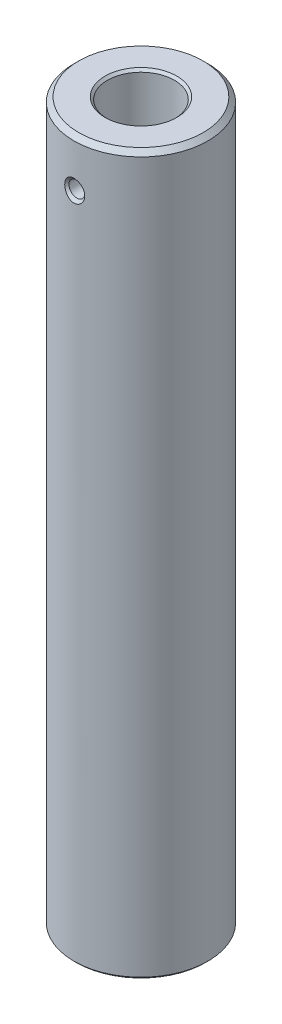
ISO-10303-21;
HEADER;
FILE_DESCRIPTION(('STEP AP214'),'2;1');
FILE_NAME('part.step','',(''),(''),'','','');
FILE_SCHEMA(('AUTOMOTIVE_DESIGN { 1 0 10303 214 1 1 1 1 }'));
ENDSEC;
DATA;
#1=APPLICATION_CONTEXT('core data for automotive mechanical design processes');
#2=APPLICATION_PROTOCOL_DEFINITION('international standard','automotive_design',2000,#1);
#3=PRODUCT_CONTEXT('',#1,'mechanical');
#4=PRODUCT('Part','Part','',(#3));
#5=PRODUCT_RELATED_PRODUCT_CATEGORY('part','',(#4));
#6=PRODUCT_DEFINITION_FORMATION('','',#4);
#7=PRODUCT_DEFINITION_CONTEXT('part definition',#1,'design');
#8=PRODUCT_DEFINITION('design','',#6,#7);
#9=PRODUCT_DEFINITION_SHAPE('','',#8);
#10=(LENGTH_UNIT() NAMED_UNIT(*) SI_UNIT(.MILLI.,.METRE.));
#11=(NAMED_UNIT(*) PLANE_ANGLE_UNIT() SI_UNIT($,.RADIAN.));
#12=(NAMED_UNIT(*) SI_UNIT($,.STERADIAN.) SOLID_ANGLE_UNIT());
#13=UNCERTAINTY_MEASURE_WITH_UNIT(LENGTH_MEASURE(1.E-05),#10,'distance_accuracy_value','');
#14=(GEOMETRIC_REPRESENTATION_CONTEXT(3) GLOBAL_UNCERTAINTY_ASSIGNED_CONTEXT((#13)) GLOBAL_UNIT_ASSIGNED_CONTEXT((#10,
#11,#12)) REPRESENTATION_CONTEXT('',''));
#15=CARTESIAN_POINT('',(0.,0.,0.));
#16=DIRECTION('',(0.,0.,1.));
#17=DIRECTION('',(1.,0.,0.));
#18=AXIS2_PLACEMENT_3D('',#15,#16,#17);
#19=CARTESIAN_POINT('',(0.,150.,0.));
#20=DIRECTION('',(0.,-1.,0.));
#21=DIRECTION('',(0.,0.,-1.));
#22=AXIS2_PLACEMENT_3D('',#19,#20,#21);
#23=CYLINDRICAL_SURFACE('',#22,14.);
#24=CARTESIAN_POINT('',(-1.53135776022729,138.468176963126,13.9159959942111));
#25=CARTESIAN_POINT('',(-1.60127764476214,138.548957642016,13.9083021061078));
#26=CARTESIAN_POINT('',(-1.66533345422651,138.634852905506,13.9007208756863));
#27=CARTESIAN_POINT('',(-1.78077358937562,138.814893823729,13.8864046729967));
#28=CARTESIAN_POINT('',(-1.83214645337011,138.909046837703,13.8796704688696));
#29=CARTESIAN_POINT('',(-1.92996888788323,139.12211198582,13.8664386029846));
#30=CARTESIAN_POINT('',(-1.97363320464747,139.242331559543,13.860228447879));
#31=CARTESIAN_POINT('',(-2.04115702723578,139.488323793423,13.8504456580711));
#32=CARTESIAN_POINT('',(-2.06500845486323,139.614098696633,13.8468740992544));
#33=CARTESIAN_POINT('',(-2.09298715096072,139.872668446938,13.8426739939634));
#34=CARTESIAN_POINT('',(-2.09634077625566,140.005549620874,13.8421608995439));
#35=CARTESIAN_POINT('',(-2.08118716452946,140.270034328525,13.8444470601918));
#36=CARTESIAN_POINT('',(-2.06267853304951,140.401637780201,13.8472465265471));
#37=CARTESIAN_POINT('',(-2.00385336318689,140.661192268973,13.8558817867143));
#38=CARTESIAN_POINT('',(-1.96331849847957,140.789093005199,13.8617479555388));
#39=CARTESIAN_POINT('',(-1.8610882733508,141.036032734745,13.8758422940061));
#40=CARTESIAN_POINT('',(-1.7993923636138,141.15507149792,13.8840705249645));
#41=CARTESIAN_POINT('',(-1.65748223155586,141.378306469293,13.9017175784515));
#42=CARTESIAN_POINT('',(-1.57764065490372,141.482740982984,13.9111109155746));
#43=CARTESIAN_POINT('',(-1.40059493770747,141.675703388028,13.9300476949973));
#44=CARTESIAN_POINT('',(-1.30339610890895,141.764236129135,13.9395910905627));
#45=CARTESIAN_POINT('',(-1.0999170018714,141.917452612588,13.9570775487696));
#46=CARTESIAN_POINT('',(-0.994428442648153,141.983178961701,13.9650797110893));
#47=CARTESIAN_POINT('',(-0.773133020119913,142.094348315229,13.9790739984405));
#48=CARTESIAN_POINT('',(-0.657332390298212,142.139803474743,13.9850673274803));
#49=CARTESIAN_POINT('',(-0.428327101943259,142.205583837824,13.9938787985151));
#50=CARTESIAN_POINT('',(-0.315607150891731,142.227572179828,13.9969056017207));
#51=CARTESIAN_POINT('',(-0.0880285048525282,142.251367596664,14.0001849305751));
#52=CARTESIAN_POINT('',(0.0268294141370952,142.253181856144,14.0004384438823));
#53=CARTESIAN_POINT('',(0.249211116987518,142.23698461402,13.9982013994123));
#54=CARTESIAN_POINT('',(0.356811134085362,142.219975279489,13.9958495447503));
#55=CARTESIAN_POINT('',(0.567640413666256,142.168445480423,13.9888853894585));
#56=CARTESIAN_POINT('',(0.670869639044375,142.133924867263,13.9842730696431));
#57=CARTESIAN_POINT('',(0.871296729335743,142.048301486374,13.9732254623816));
#58=CARTESIAN_POINT('',(0.968423934262403,141.997036303114,13.9667724014763));
#59=CARTESIAN_POINT('',(1.1532880828759,141.879856250496,13.9527250532927));
#60=CARTESIAN_POINT('',(1.24102283340762,141.81393797062,13.9451305004649));
#61=CARTESIAN_POINT('',(1.41028376270478,141.665167417869,13.9290618468448));
#62=CARTESIAN_POINT('',(1.49112308764273,141.581537223889,13.9205623107645));
#63=CARTESIAN_POINT('',(1.63874712127917,141.402652045635,13.903957675865));
#64=CARTESIAN_POINT('',(1.70552733334932,141.307393357478,13.8958527038773));
#65=CARTESIAN_POINT('',(1.82818769716662,141.100538358997,13.8802679531317));
#66=CARTESIAN_POINT('',(1.88292721894083,140.988258352901,13.8728760468477));
#67=CARTESIAN_POINT('',(1.97394595926302,140.756338490784,13.8602184306113));
#68=CARTESIAN_POINT('',(2.01022039243926,140.636696735905,13.854953271895));
#69=CARTESIAN_POINT('',(2.06505190998251,140.386869742714,13.8468906918943));
#70=CARTESIAN_POINT('',(2.08260411797717,140.256458525243,13.8442337938247));
#71=CARTESIAN_POINT('',(2.09627245927022,139.994484997263,13.8421706416678));
#72=CARTESIAN_POINT('',(2.09238539951781,139.862922518205,13.842764871786));
#73=CARTESIAN_POINT('',(2.06295333228332,139.599656131464,13.8471820432034));
#74=CARTESIAN_POINT('',(2.03698336478367,139.468000450473,13.8510683307278));
#75=CARTESIAN_POINT('',(1.96331839276869,139.211010689411,13.8617010339261));
#76=CARTESIAN_POINT('',(1.91562206802213,139.085676994017,13.8684476234084));
#77=CARTESIAN_POINT('',(1.79996028300474,138.846192891427,13.8839297212903));
#78=CARTESIAN_POINT('',(1.73217434096815,138.731954861105,13.8926474587093));
#79=CARTESIAN_POINT('',(1.57760105894845,138.517196760224,13.9110463033582));
#80=CARTESIAN_POINT('',(1.49081689892042,138.416674398477,13.9207272492169));
#81=CARTESIAN_POINT('',(1.30437387879809,138.237031205091,13.9394042422191));
#82=CARTESIAN_POINT('',(1.2054197936225,138.157181839928,13.9484119055677));
#83=CARTESIAN_POINT('',(0.994544195131819,138.016773832754,13.9650285578943));
#84=CARTESIAN_POINT('',(0.882629862947548,137.956204576934,13.972638315448));
#85=CARTESIAN_POINT('',(0.657880600130233,137.860850041201,13.9849528210744));
#86=CARTESIAN_POINT('',(0.545722145073133,137.824492756417,13.9898304105963));
#87=CARTESIAN_POINT('',(0.31663823744272,137.772444103654,13.9968866996364));
#88=CARTESIAN_POINT('',(0.199715209735977,137.756742355457,13.9990667547388));
#89=CARTESIAN_POINT('',(-0.0273628075260406,137.747082906316,14.0004037892334));
#90=CARTESIAN_POINT('',(-0.137461322916734,137.751772604662,13.9997488333666));
#91=CARTESIAN_POINT('',(-0.35524707084623,137.779643843199,13.995915803131));
#92=CARTESIAN_POINT('',(-0.462934261837606,137.802825701761,13.9927376853221));
#93=CARTESIAN_POINT('',(-0.671693957348671,137.866335623105,13.9842639363403));
#94=CARTESIAN_POINT('',(-0.772826536229986,137.906470843267,13.9789921594535));
#95=CARTESIAN_POINT('',(-0.967253953326416,138.002324603407,13.9668862467392));
#96=CARTESIAN_POINT('',(-1.06055160164878,138.058037524917,13.9600526743723));
#97=CARTESIAN_POINT('',(-1.21943577141882,138.170492445145,13.9469709891212));
#98=CARTESIAN_POINT('',(-1.28681335132365,138.224754034039,13.9408833789934));
#99=CARTESIAN_POINT('',(-1.41452195716676,138.34095723969,13.9285046220588));
#100=CARTESIAN_POINT('',(-1.47485461442085,138.402897071605,13.9222135228042));
#101=CARTESIAN_POINT('',(-1.53135776022729,138.468176963126,13.9159959942111));
#102=B_SPLINE_CURVE_WITH_KNOTS('',3,(#24,#25,#26,#27,#28,#29,#30,#31,#32,#33,#34,#35,#36,#37,
#38,#39,#40,#41,#42,#43,#44,#45,#46,#47,#48,#49,#50,#51,#52,#53,#54,#55,#56,#57,#58,#59,#60,#61,
#62,#63,#64,#65,#66,#67,#68,#69,#70,#71,#72,#73,#74,#75,#76,#77,#78,#79,#80,#81,#82,#83,#84,#85,
#86,#87,#88,#89,#90,#91,#92,#93,#94,#95,#96,#97,#98,#99,#100,#101),.UNSPECIFIED.,.T.,.F.,(4,2,2,
2,2,2,2,2,2,2,2,2,2,2,2,2,2,2,2,2,2,2,2,2,2,2,2,2,2,2,2,2,2,2,2,2,2,2,4),(0.,0.321111598311164,
0.642512334418354,1.02491696386992,1.40747743256409,1.80439185218487,2.201331589901,
2.60227957691264,3.00323797284468,3.39660650326646,3.78985485890881,4.16151011353402,
4.53294221399786,4.87582246978047,5.21858061081795,5.54393186724936,5.86928588512925,
6.19789438592272,6.52657945080125,6.87495603822549,7.22344388075731,7.5971862908592,
7.97102550997304,8.36405163147757,8.75713628978807,9.15796118760692,9.5588104453382,
9.95618054845076,10.3534841898444,10.7338858266659,11.1140776866143,11.4662331807764,
11.8182116352824,12.1472118287886,12.4762176866548,12.8015778480361,13.1268208115693,
13.3863753902016,13.6458697469245),.UNSPECIFIED.);
#103=CARTESIAN_POINT('',(-1.53135776022729,138.468176963126,13.9159959942111));
#104=VERTEX_POINT('',#103);
#105=EDGE_CURVE('E11',#104,#104,#102,.T.);
#106=ORIENTED_EDGE('',*,*,#105,.T.);
#107=EDGE_LOOP('',(#106));
#108=FACE_BOUND('',#107,.T.);
#109=CARTESIAN_POINT('',(0.,0.499999999999973,0.));
#110=DIRECTION('',(0.,1.,0.));
#111=DIRECTION('',(0.,0.,1.));
#112=AXIS2_PLACEMENT_3D('',#109,#110,#111);
#113=CIRCLE('',#112,14.);
#114=CARTESIAN_POINT('',(0.,0.499999999999973,14.));
#115=VERTEX_POINT('',#114);
#116=EDGE_CURVE('E86',#115,#115,#113,.T.);
#117=ORIENTED_EDGE('',*,*,#116,.T.);
#118=EDGE_LOOP('',(#117));
#119=FACE_BOUND('',#118,.T.);
#120=CARTESIAN_POINT('',(0.,149.,0.));
#121=DIRECTION('',(0.,1.,0.));
#122=DIRECTION('',(0.,0.,1.));
#123=AXIS2_PLACEMENT_3D('',#120,#121,#122);
#124=CIRCLE('',#123,14.);
#125=CARTESIAN_POINT('',(0.,149.,14.));
#126=VERTEX_POINT('',#125);
#127=EDGE_CURVE('E83',#126,#126,#124,.F.);
#128=ORIENTED_EDGE('',*,*,#127,.T.);
#129=EDGE_LOOP('',(#128));
#130=FACE_BOUND('',#129,.T.);
#131=ADVANCED_FACE('F36',(#108,#119,#130),#23,.T.);
#132=CARTESIAN_POINT('',(0.,150.,0.));
#133=DIRECTION('',(0.,1.,0.));
#134=DIRECTION('',(0.,0.,1.));
#135=AXIS2_PLACEMENT_3D('',#132,#133,#134);
#136=PLANE('',#135);
#137=CARTESIAN_POINT('',(0.,150.,0.));
#138=DIRECTION('',(0.,1.,0.));
#139=DIRECTION('',(0.,0.,1.));
#140=AXIS2_PLACEMENT_3D('',#137,#138,#139);
#141=CIRCLE('',#140,7.5);
#142=CARTESIAN_POINT('',(0.,150.,7.5));
#143=VERTEX_POINT('',#142);
#144=EDGE_CURVE('E65',#143,#143,#141,.T.);
#145=ORIENTED_EDGE('',*,*,#144,.F.);
#146=EDGE_LOOP('',(#145));
#147=FACE_BOUND('',#146,.T.);
#148=CARTESIAN_POINT('',(0.,150.,0.));
#149=DIRECTION('',(0.,1.,0.));
#150=DIRECTION('',(0.,0.,1.));
#151=AXIS2_PLACEMENT_3D('',#148,#149,#150);
#152=CIRCLE('',#151,13.);
#153=CARTESIAN_POINT('',(0.,150.,13.));
#154=VERTEX_POINT('',#153);
#155=EDGE_CURVE('E80',#154,#154,#152,.T.);
#156=ORIENTED_EDGE('',*,*,#155,.T.);
#157=EDGE_LOOP('',(#156));
#158=FACE_BOUND('',#157,.T.);
#159=ADVANCED_FACE('F97',(#147,#158),#136,.T.);
#160=CARTESIAN_POINT('',(0.,0.,0.));
#161=DIRECTION('',(0.,1.,0.));
#162=DIRECTION('',(0.,0.,1.));
#163=AXIS2_PLACEMENT_3D('',#160,#161,#162);
#164=PLANE('',#163);
#165=CARTESIAN_POINT('',(0.,0.,0.));
#166=DIRECTION('',(0.,-1.,0.));
#167=DIRECTION('',(0.,0.,-1.));
#168=AXIS2_PLACEMENT_3D('',#165,#166,#167);
#169=CIRCLE('',#168,3.5);
#170=CARTESIAN_POINT('',(0.,0.,-3.5));
#171=VERTEX_POINT('',#170);
#172=EDGE_CURVE('E66',#171,#171,#169,.T.);
#173=ORIENTED_EDGE('',*,*,#172,.F.);
#174=EDGE_LOOP('',(#173));
#175=FACE_BOUND('',#174,.T.);
#176=CARTESIAN_POINT('',(0.,0.,0.));
#177=DIRECTION('',(0.,1.,0.));
#178=DIRECTION('',(0.,0.,1.));
#179=AXIS2_PLACEMENT_3D('',#176,#177,#178);
#180=CIRCLE('',#179,13.5);
#181=CARTESIAN_POINT('',(0.,0.,13.5));
#182=VERTEX_POINT('',#181);
#183=EDGE_CURVE('E49',#182,#182,#180,.F.);
#184=ORIENTED_EDGE('',*,*,#183,.T.);
#185=EDGE_LOOP('',(#184));
#186=FACE_BOUND('',#185,.T.);
#187=ADVANCED_FACE('F99',(#175,#186),#164,.F.);
#188=CARTESIAN_POINT('',(0.,150.,0.));
#189=DIRECTION('',(0.,-1.,0.));
#190=DIRECTION('',(0.,0.,-1.));
#191=AXIS2_PLACEMENT_3D('',#188,#189,#190);
#192=CONICAL_SURFACE('',#191,13.,0.785398163397456);
#193=ORIENTED_EDGE('',*,*,#127,.F.);
#194=EDGE_LOOP('',(#193));
#195=FACE_BOUND('',#194,.T.);
#196=ORIENTED_EDGE('',*,*,#155,.F.);
#197=EDGE_LOOP('',(#196));
#198=FACE_BOUND('',#197,.T.);
#199=ADVANCED_FACE('F101',(#195,#198),#192,.T.);
#200=CARTESIAN_POINT('',(0.,115.,0.));
#201=DIRECTION('',(0.,1.,0.));
#202=DIRECTION('',(0.,0.,1.));
#203=AXIS2_PLACEMENT_3D('',#200,#201,#202);
#204=CONICAL_SURFACE('',#203,6.99999999999999,1.02974425867665);
#205=CARTESIAN_POINT('',(0.,110.793975666807,0.));
#206=VERTEX_POINT('',#205);
#207=VERTEX_LOOP('',#206);
#208=FACE_BOUND('',#207,.T.);
#209=CARTESIAN_POINT('',(0.,115.,0.));
#210=DIRECTION('',(0.,1.,0.));
#211=DIRECTION('',(0.,0.,1.));
#212=AXIS2_PLACEMENT_3D('',#209,#210,#211);
#213=CIRCLE('',#212,6.99999999999999);
#214=CARTESIAN_POINT('',(0.,115.,6.99999999999999));
#215=VERTEX_POINT('',#214);
#216=EDGE_CURVE('E77',#215,#215,#213,.T.);
#217=ORIENTED_EDGE('',*,*,#216,.T.);
#218=EDGE_LOOP('',(#217));
#219=FACE_BOUND('',#218,.T.);
#220=ADVANCED_FACE('F103',(#208,#219),#204,.F.);
#221=CARTESIAN_POINT('',(0.,150.,0.));
#222=DIRECTION('',(0.,1.,0.));
#223=DIRECTION('',(0.,0.,1.));
#224=AXIS2_PLACEMENT_3D('',#221,#222,#223);
#225=CYLINDRICAL_SURFACE('',#224,6.99999999999999);
#226=CARTESIAN_POINT('',(0.,138.35,6.99999999999999));
#227=CARTESIAN_POINT('',(0.0913287393176132,138.350002843879,6.99999836647251));
#228=CARTESIAN_POINT('',(0.182690417283305,138.357608230849,6.99819467849872));
#229=CARTESIAN_POINT('',(0.362806323664361,138.387789901469,6.99117390365259));
#230=CARTESIAN_POINT('',(0.451558855012931,138.410375713275,6.98595464436712));
#231=CARTESIAN_POINT('',(0.623828476855956,138.469761774017,6.97268218331076));
#232=CARTESIAN_POINT('',(0.70735134881968,138.506545992007,6.96463217854925));
#233=CARTESIAN_POINT('',(0.867039208328412,138.593230848715,6.94656095410579));
#234=CARTESIAN_POINT('',(0.943204151262114,138.643131566953,6.93653972247337));
#235=CARTESIAN_POINT('',(1.0874214344422,138.755606821652,6.91541181493804));
#236=CARTESIAN_POINT('',(1.15531854158778,138.818377553555,6.90428991213627));
#237=CARTESIAN_POINT('',(1.2797250827413,138.954390409173,6.88231817514456));
#238=CARTESIAN_POINT('',(1.33623336463363,139.027633591022,6.87146836857752));
#239=CARTESIAN_POINT('',(1.4369668461877,139.183690367456,6.85111743990826));
#240=CARTESIAN_POINT('',(1.48102236520304,139.266616250423,6.84163573776828));
#241=CARTESIAN_POINT('',(1.55450989151089,139.438955721702,6.8253150534534));
#242=CARTESIAN_POINT('',(1.58394395433771,139.528368396052,6.81847569983818));
#243=CARTESIAN_POINT('',(1.62683125284545,139.709446972031,6.80836995693016));
#244=CARTESIAN_POINT('',(1.64056162843083,139.801043704224,6.80504168835828));
#245=CARTESIAN_POINT('',(1.6525143545755,139.985296353664,6.80214944752778));
#246=CARTESIAN_POINT('',(1.6507389330696,140.077952116834,6.80258493447764));
#247=CARTESIAN_POINT('',(1.63195247769313,140.259599180796,6.80711518628286));
#248=CARTESIAN_POINT('',(1.61526770664354,140.348626479963,6.81113158544196));
#249=CARTESIAN_POINT('',(1.56765494743682,140.522581519513,6.82224669705885));
#250=CARTESIAN_POINT('',(1.53672604569691,140.607508996556,6.82934560721948));
#251=CARTESIAN_POINT('',(1.46121486998611,140.771748397053,6.84590028619907));
#252=CARTESIAN_POINT('',(1.41651088097452,140.851002169397,6.85537691977426));
#253=CARTESIAN_POINT('',(1.31480384080149,141.001002120948,6.87560701771075));
#254=CARTESIAN_POINT('',(1.25779885989576,141.071746962584,6.88636068228984));
#255=CARTESIAN_POINT('',(1.13140044923304,141.204594797696,6.90826612497408));
#256=CARTESIAN_POINT('',(1.06173067039406,141.266434627954,6.91942110106381));
#257=CARTESIAN_POINT('',(0.912878848692445,141.377599647001,6.94062641864199));
#258=CARTESIAN_POINT('',(0.833696575268972,141.426924532367,6.9506767333447));
#259=CARTESIAN_POINT('',(0.667717693598582,141.511741023479,6.96858169507369));
#260=CARTESIAN_POINT('',(0.580900533100744,141.547193798679,6.97643016161575));
#261=CARTESIAN_POINT('',(0.402313719817352,141.602931553437,6.98900179511063));
#262=CARTESIAN_POINT('',(0.310544909289154,141.623219103878,6.99372549177408));
#263=CARTESIAN_POINT('',(0.126913198899197,141.647657684333,6.99943837162219));
#264=CARTESIAN_POINT('',(0.0351005767602113,141.652167596699,7.00051059686151));
#265=CARTESIAN_POINT('',(-0.147966685501663,141.645901723631,6.99903444009397));
#266=CARTESIAN_POINT('',(-0.239221369368369,141.635127152384,6.99648634568226));
#267=CARTESIAN_POINT('',(-0.41736265301978,141.598894920763,6.98810869992011));
#268=CARTESIAN_POINT('',(-0.504290552421118,141.573629486476,6.98232213187252));
#269=CARTESIAN_POINT('',(-0.672672276070135,141.509349349124,6.96811723407211));
#270=CARTESIAN_POINT('',(-0.754125584648722,141.470333353004,6.95969865682289));
#271=CARTESIAN_POINT('',(-0.910700498955403,141.378939577914,6.94096161251793));
#272=CARTESIAN_POINT('',(-0.985698570997656,141.326356139424,6.93061465221503));
#273=CARTESIAN_POINT('',(-1.12593444955909,141.209586680757,6.90921937825114));
#274=CARTESIAN_POINT('',(-1.19117076625592,141.145398892839,6.89817095790026));
#275=CARTESIAN_POINT('',(-1.31148229591091,141.005584944694,6.87632466673188));
#276=CARTESIAN_POINT('',(-1.36630717929423,140.929741387403,6.86553738570699));
#277=CARTESIAN_POINT('',(-1.46244648293613,140.769715207675,6.84570445168462));
#278=CARTESIAN_POINT('',(-1.50376150719304,140.685532958264,6.83665872083342));
#279=CARTESIAN_POINT('',(-1.57141076668763,140.511678725539,6.82142736146697));
#280=CARTESIAN_POINT('',(-1.59783286852026,140.422042473142,6.81522499881538));
#281=CARTESIAN_POINT('',(-1.63519178674543,140.239434344163,6.80635903572141));
#282=CARTESIAN_POINT('',(-1.64613154940224,140.146463105679,6.80369476199233));
#283=CARTESIAN_POINT('',(-1.65207449167985,139.962359924164,6.80225382726605));
#284=CARTESIAN_POINT('',(-1.64747616169189,139.871241386899,6.80337995460539));
#285=CARTESIAN_POINT('',(-1.62337546677892,139.691117636333,6.80917049161346));
#286=CARTESIAN_POINT('',(-1.60387333967239,139.602112389335,6.81383484482305));
#287=CARTESIAN_POINT('',(-1.55072477614988,139.429119893937,6.82612522897375));
#288=CARTESIAN_POINT('',(-1.51714519678736,139.345111042248,6.83373724790253));
#289=CARTESIAN_POINT('',(-1.43684939858623,139.18386348852,6.85106877692284));
#290=CARTESIAN_POINT('',(-1.39013156490446,139.106625620245,6.86078854604758));
#291=CARTESIAN_POINT('',(-1.2836020453789,138.959168348297,6.88152384189012));
#292=CARTESIAN_POINT('',(-1.22351026298737,138.889154768895,6.89256431174074));
#293=CARTESIAN_POINT('',(-1.09249493531382,138.76007516111,6.91453965388042));
#294=CARTESIAN_POINT('',(-1.02156885982583,138.701011697134,6.92547450086676));
#295=CARTESIAN_POINT('',(-0.869562734220011,138.59461714467,6.94620969725689));
#296=CARTESIAN_POINT('',(-0.788341489140663,138.547483546436,6.95598967744617));
#297=CARTESIAN_POINT('',(-0.618909771082378,138.467613790428,6.97310375804726));
#298=CARTESIAN_POINT('',(-0.530704778601505,138.434866472623,6.98043975328752));
#299=CARTESIAN_POINT('',(-0.368778884805451,138.390025779499,6.99064750922865));
#300=CARTESIAN_POINT('',(-0.295881946838858,138.375046708784,6.99413174237216));
#301=CARTESIAN_POINT('',(-0.148663891408628,138.355032956133,6.99880858473133));
#302=CARTESIAN_POINT('',(-0.0743428585838592,138.349997685043,7.00000132971398));
#303=CARTESIAN_POINT('',(0.,138.35,6.99999999999999));
#304=B_SPLINE_CURVE_WITH_KNOTS('',3,(#226,#227,#228,#229,#230,#231,#232,#233,#234,#235,#236,
#237,#238,#239,#240,#241,#242,#243,#244,#245,#246,#247,#248,#249,#250,#251,#252,#253,#254,#255,
#256,#257,#258,#259,#260,#261,#262,#263,#264,#265,#266,#267,#268,#269,#270,#271,#272,#273,#274,
#275,#276,#277,#278,#279,#280,#281,#282,#283,#284,#285,#286,#287,#288,#289,#290,#291,#292,#293,
#294,#295,#296,#297,#298,#299,#300,#301,#302,#303),.UNSPECIFIED.,.T.,.F.,(4,2,2,2,2,2,2,2,2,2,2,
2,2,2,2,2,2,2,2,2,2,2,2,2,2,2,2,2,2,2,2,2,2,2,2,2,2,2,4),(0.,0.273713930465043,
0.547602121208318,0.821181974218384,1.09476348584583,1.37287554367487,1.65101572175225,
1.93278083587445,2.21450632727553,2.49117922951626,2.76781237894395,3.03853628105217,
3.30927754913056,3.58248319512942,3.85573173204488,4.13587649000041,4.41602803938652,
4.6969582676398,4.97784086042082,5.25229133365968,5.52672000600243,5.79758981692426,
6.06848510628019,6.34375631656426,6.61906949551372,6.90033819981437,7.18159432744311,
7.46117322376549,7.74069890951605,8.01311084713948,8.28551843800224,8.55664670189886,
8.82780830516568,9.10529722607669,9.38285105021358,9.66473658497745,9.94640306170596,
10.1692231938146,10.3920301237803),.UNSPECIFIED.);
#305=CARTESIAN_POINT('',(0.,138.35,6.99999999999999));
#306=VERTEX_POINT('',#305);
#307=EDGE_CURVE('E40',#306,#306,#304,.T.);
#308=ORIENTED_EDGE('',*,*,#307,.T.);
#309=EDGE_LOOP('',(#308));
#310=FACE_BOUND('',#309,.T.);
#311=ORIENTED_EDGE('',*,*,#216,.F.);
#312=EDGE_LOOP('',(#311));
#313=FACE_BOUND('',#312,.T.);
#314=CARTESIAN_POINT('',(0.,149.5,0.));
#315=DIRECTION('',(0.,1.,0.));
#316=DIRECTION('',(0.,0.,1.));
#317=AXIS2_PLACEMENT_3D('',#314,#315,#316);
#318=CIRCLE('',#317,7.);
#319=CARTESIAN_POINT('',(0.,149.5,7.));
#320=VERTEX_POINT('',#319);
#321=EDGE_CURVE('E69',#320,#320,#318,.T.);
#322=ORIENTED_EDGE('',*,*,#321,.T.);
#323=EDGE_LOOP('',(#322));
#324=FACE_BOUND('',#323,.T.);
#325=ADVANCED_FACE('F111',(#310,#313,#324),#225,.F.);
#326=CARTESIAN_POINT('',(0.,150.,0.));
#327=DIRECTION('',(0.,1.,0.));
#328=DIRECTION('',(0.,0.,1.));
#329=AXIS2_PLACEMENT_3D('',#326,#327,#328);
#330=CONICAL_SURFACE('',#329,7.5,0.785398163397452);
#331=ORIENTED_EDGE('',*,*,#321,.F.);
#332=EDGE_LOOP('',(#331));
#333=FACE_BOUND('',#332,.T.);
#334=ORIENTED_EDGE('',*,*,#144,.T.);
#335=EDGE_LOOP('',(#334));
#336=FACE_BOUND('',#335,.T.);
#337=ADVANCED_FACE('F106',(#333,#336),#330,.F.);
#338=CARTESIAN_POINT('',(0.,0.499999999999973,0.));
#339=DIRECTION('',(0.,1.,0.));
#340=DIRECTION('',(0.,0.,1.));
#341=AXIS2_PLACEMENT_3D('',#338,#339,#340);
#342=CONICAL_SURFACE('',#341,14.,0.78539816339745);
#343=ORIENTED_EDGE('',*,*,#183,.F.);
#344=EDGE_LOOP('',(#343));
#345=FACE_BOUND('',#344,.T.);
#346=ORIENTED_EDGE('',*,*,#116,.F.);
#347=EDGE_LOOP('',(#346));
#348=FACE_BOUND('',#347,.T.);
#349=ADVANCED_FACE('F59',(#345,#348),#342,.T.);
#350=CARTESIAN_POINT('',(0.,25.,0.));
#351=DIRECTION('',(0.,-1.,0.));
#352=DIRECTION('',(0.,0.,-1.));
#353=AXIS2_PLACEMENT_3D('',#350,#351,#352);
#354=CONICAL_SURFACE('',#353,3.49999999999999,1.02974425867665);
#355=CARTESIAN_POINT('',(0.,27.1030121665965,0.));
#356=VERTEX_POINT('',#355);
#357=VERTEX_LOOP('',#356);
#358=FACE_BOUND('',#357,.T.);
#359=CARTESIAN_POINT('',(0.,25.,0.));
#360=DIRECTION('',(0.,-1.,0.));
#361=DIRECTION('',(0.,0.,-1.));
#362=AXIS2_PLACEMENT_3D('',#359,#360,#361);
#363=CIRCLE('',#362,3.49999999999999);
#364=CARTESIAN_POINT('',(0.,25.,-3.49999999999999));
#365=VERTEX_POINT('',#364);
#366=EDGE_CURVE('E63',#365,#365,#363,.T.);
#367=ORIENTED_EDGE('',*,*,#366,.T.);
#368=EDGE_LOOP('',(#367));
#369=FACE_BOUND('',#368,.T.);
#370=ADVANCED_FACE('F55',(#358,#369),#354,.F.);
#371=CARTESIAN_POINT('',(0.,0.,0.));
#372=DIRECTION('',(0.,-1.,0.));
#373=DIRECTION('',(0.,0.,-1.));
#374=AXIS2_PLACEMENT_3D('',#371,#372,#373);
#375=CYLINDRICAL_SURFACE('',#374,3.5);
#376=ORIENTED_EDGE('',*,*,#366,.F.);
#377=EDGE_LOOP('',(#376));
#378=FACE_BOUND('',#377,.T.);
#379=ORIENTED_EDGE('',*,*,#172,.T.);
#380=EDGE_LOOP('',(#379));
#381=FACE_BOUND('',#380,.T.);
#382=ADVANCED_FACE('F58',(#378,#381),#375,.F.);
#383=CARTESIAN_POINT('',(0.,140.,0.));
#384=DIRECTION('',(0.,0.,-1.));
#385=DIRECTION('',(-1.,0.,0.));
#386=AXIS2_PLACEMENT_3D('',#383,#384,#385);
#387=CYLINDRICAL_SURFACE('',#386,1.64999999999999);
#388=CARTESIAN_POINT('',(0.,140.,13.4));
#389=DIRECTION('',(0.,0.,-1.));
#390=DIRECTION('',(-1.,0.,0.));
#391=AXIS2_PLACEMENT_3D('',#388,#389,#390);
#392=CIRCLE('',#391,1.64999999999999);
#393=CARTESIAN_POINT('',(-1.64999999999999,140.,13.4));
#394=VERTEX_POINT('',#393);
#395=EDGE_CURVE('E150',#394,#394,#392,.T.);
#396=ORIENTED_EDGE('',*,*,#395,.F.);
#397=EDGE_LOOP('',(#396));
#398=FACE_BOUND('',#397,.T.);
#399=ORIENTED_EDGE('',*,*,#307,.F.);
#400=EDGE_LOOP('',(#399));
#401=FACE_BOUND('',#400,.T.);
#402=ADVANCED_FACE('F138',(#398,#401),#387,.F.);
#403=CARTESIAN_POINT('',(0.,140.,13.4));
#404=DIRECTION('',(0.,0.,1.));
#405=DIRECTION('',(1.,0.,0.));
#406=AXIS2_PLACEMENT_3D('',#403,#404,#405);
#407=CONICAL_SURFACE('',#406,1.64999999999999,0.785398163397454);
#408=ORIENTED_EDGE('',*,*,#105,.F.);
#409=EDGE_LOOP('',(#408));
#410=FACE_BOUND('',#409,.T.);
#411=ORIENTED_EDGE('',*,*,#395,.T.);
#412=EDGE_LOOP('',(#411));
#413=FACE_BOUND('',#412,.T.);
#414=ADVANCED_FACE('F139',(#410,#413),#407,.F.);
#415=CLOSED_SHELL('',(#131,#159,#187,#199,#220,#325,#337,#349,#370,#382,#402,#414));
#416=MANIFOLD_SOLID_BREP('B2',#415);
#417=ADVANCED_BREP_SHAPE_REPRESENTATION('',(#18,#416),#14);
#418=SHAPE_DEFINITION_REPRESENTATION(#9,#417);
ENDSEC;
END-ISO-10303-21;
